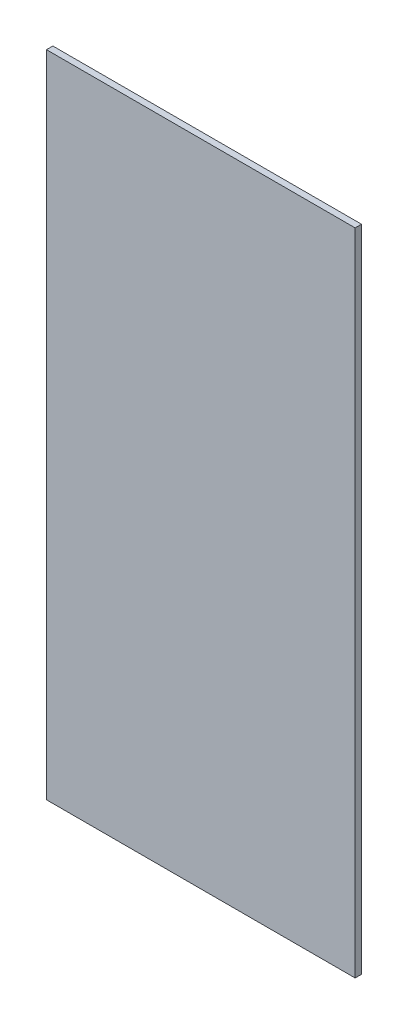
ISO-10303-21;
HEADER;
FILE_DESCRIPTION(('STEP AP214'),'2;1');
FILE_NAME('part.step','',(''),(''),'','','');
FILE_SCHEMA(('AUTOMOTIVE_DESIGN { 1 0 10303 214 1 1 1 1 }'));
ENDSEC;
DATA;
#1=APPLICATION_CONTEXT('core data for automotive mechanical design processes');
#2=APPLICATION_PROTOCOL_DEFINITION('international standard','automotive_design',2000,#1);
#3=PRODUCT_CONTEXT('',#1,'mechanical');
#4=PRODUCT('Part','Part','',(#3));
#5=PRODUCT_RELATED_PRODUCT_CATEGORY('part','',(#4));
#6=PRODUCT_DEFINITION_FORMATION('','',#4);
#7=PRODUCT_DEFINITION_CONTEXT('part definition',#1,'design');
#8=PRODUCT_DEFINITION('design','',#6,#7);
#9=PRODUCT_DEFINITION_SHAPE('','',#8);
#10=(LENGTH_UNIT() NAMED_UNIT(*) SI_UNIT(.MILLI.,.METRE.));
#11=(NAMED_UNIT(*) PLANE_ANGLE_UNIT() SI_UNIT($,.RADIAN.));
#12=(NAMED_UNIT(*) SI_UNIT($,.STERADIAN.) SOLID_ANGLE_UNIT());
#13=UNCERTAINTY_MEASURE_WITH_UNIT(LENGTH_MEASURE(1.E-05),#10,'distance_accuracy_value','');
#14=(GEOMETRIC_REPRESENTATION_CONTEXT(3) GLOBAL_UNCERTAINTY_ASSIGNED_CONTEXT((#13)) GLOBAL_UNIT_ASSIGNED_CONTEXT((#10,
#11,#12)) REPRESENTATION_CONTEXT('',''));
#15=CARTESIAN_POINT('',(0.,0.,0.));
#16=DIRECTION('',(0.,0.,1.));
#17=DIRECTION('',(1.,0.,0.));
#18=AXIS2_PLACEMENT_3D('',#15,#16,#17);
#19=CARTESIAN_POINT('',(-134.196553606128,367.959213729015,11.90625));
#20=DIRECTION('',(1.,0.,0.));
#21=DIRECTION('',(0.,1.,0.));
#22=AXIS2_PLACEMENT_3D('',#19,#20,#21);
#23=PLANE('',#22);
#24=DIRECTION('',(0.,-1.,0.));
#25=VECTOR('',#24,1.);
#26=CARTESIAN_POINT('',(-134.196553606128,367.959213729015,0.));
#27=LINE('',#26,#25);
#28=CARTESIAN_POINT('',(-134.196553606128,367.959213729015,0.));
#29=VERTEX_POINT('',#28);
#30=CARTESIAN_POINT('',(-134.196553606128,-844.890786270985,0.));
#31=VERTEX_POINT('',#30);
#32=EDGE_CURVE('E95',#29,#31,#27,.T.);
#33=ORIENTED_EDGE('',*,*,#32,.T.);
#34=DIRECTION('',(0.,0.,-1.));
#35=VECTOR('',#34,1.);
#36=CARTESIAN_POINT('',(-134.196553606128,-844.890786270985,11.90625));
#37=LINE('',#36,#35);
#38=CARTESIAN_POINT('',(-134.196553606128,-844.890786270985,11.90625));
#39=VERTEX_POINT('',#38);
#40=EDGE_CURVE('E11',#39,#31,#37,.T.);
#41=ORIENTED_EDGE('',*,*,#40,.F.);
#42=DIRECTION('',(0.,-1.,0.));
#43=VECTOR('',#42,1.);
#44=CARTESIAN_POINT('',(-134.196553606128,367.959213729015,11.90625));
#45=LINE('',#44,#43);
#46=CARTESIAN_POINT('',(-134.196553606128,367.959213729015,11.90625));
#47=VERTEX_POINT('',#46);
#48=EDGE_CURVE('E83',#47,#39,#45,.T.);
#49=ORIENTED_EDGE('',*,*,#48,.F.);
#50=DIRECTION('',(0.,0.,-1.));
#51=VECTOR('',#50,1.);
#52=CARTESIAN_POINT('',(-134.196553606128,367.959213729015,11.90625));
#53=LINE('',#52,#51);
#54=EDGE_CURVE('E91',#47,#29,#53,.T.);
#55=ORIENTED_EDGE('',*,*,#54,.T.);
#56=EDGE_LOOP('',(#33,#41,#49,#55));
#57=FACE_BOUND('',#56,.T.);
#58=ADVANCED_FACE('F32',(#57),#23,.F.);
#59=CARTESIAN_POINT('',(-134.196553606128,-844.890786270985,11.90625));
#60=DIRECTION('',(0.,1.,0.));
#61=DIRECTION('',(0.,0.,1.));
#62=AXIS2_PLACEMENT_3D('',#59,#60,#61);
#63=PLANE('',#62);
#64=DIRECTION('',(1.,0.,0.));
#65=VECTOR('',#64,1.);
#66=CARTESIAN_POINT('',(-134.196553606128,-844.890786270985,0.));
#67=LINE('',#66,#65);
#68=CARTESIAN_POINT('',(442.065946393872,-844.890786270985,0.));
#69=VERTEX_POINT('',#68);
#70=EDGE_CURVE('E87',#31,#69,#67,.T.);
#71=ORIENTED_EDGE('',*,*,#70,.T.);
#72=DIRECTION('',(0.,0.,-1.));
#73=VECTOR('',#72,1.);
#74=CARTESIAN_POINT('',(442.065946393872,-844.890786270985,11.90625));
#75=LINE('',#74,#73);
#76=CARTESIAN_POINT('',(442.065946393872,-844.890786270985,11.90625));
#77=VERTEX_POINT('',#76);
#78=EDGE_CURVE('E40',#77,#69,#75,.T.);
#79=ORIENTED_EDGE('',*,*,#78,.F.);
#80=DIRECTION('',(1.,0.,0.));
#81=VECTOR('',#80,1.);
#82=CARTESIAN_POINT('',(-134.196553606128,-844.890786270985,11.90625));
#83=LINE('',#82,#81);
#84=EDGE_CURVE('E78',#39,#77,#83,.T.);
#85=ORIENTED_EDGE('',*,*,#84,.F.);
#86=ORIENTED_EDGE('',*,*,#40,.T.);
#87=EDGE_LOOP('',(#71,#79,#85,#86));
#88=FACE_BOUND('',#87,.T.);
#89=ADVANCED_FACE('F86',(#88),#63,.F.);
#90=CARTESIAN_POINT('',(442.065946393872,367.959213729015,11.90625));
#91=DIRECTION('',(-1.,0.,0.));
#92=DIRECTION('',(0.,-1.,0.));
#93=AXIS2_PLACEMENT_3D('',#90,#91,#92);
#94=PLANE('',#93);
#95=DIRECTION('',(0.,1.,0.));
#96=VECTOR('',#95,1.);
#97=CARTESIAN_POINT('',(442.065946393872,367.959213729015,0.));
#98=LINE('',#97,#96);
#99=CARTESIAN_POINT('',(442.065946393872,367.959213729015,0.));
#100=VERTEX_POINT('',#99);
#101=EDGE_CURVE('E65',#69,#100,#98,.T.);
#102=ORIENTED_EDGE('',*,*,#101,.T.);
#103=DIRECTION('',(0.,0.,-1.));
#104=VECTOR('',#103,1.);
#105=CARTESIAN_POINT('',(442.065946393872,367.959213729015,11.90625));
#106=LINE('',#105,#104);
#107=CARTESIAN_POINT('',(442.065946393872,367.959213729015,11.90625));
#108=VERTEX_POINT('',#107);
#109=EDGE_CURVE('E88',#108,#100,#106,.T.);
#110=ORIENTED_EDGE('',*,*,#109,.F.);
#111=DIRECTION('',(0.,1.,0.));
#112=VECTOR('',#111,1.);
#113=CARTESIAN_POINT('',(442.065946393872,367.959213729015,11.90625));
#114=LINE('',#113,#112);
#115=EDGE_CURVE('E81',#77,#108,#114,.T.);
#116=ORIENTED_EDGE('',*,*,#115,.F.);
#117=ORIENTED_EDGE('',*,*,#78,.T.);
#118=EDGE_LOOP('',(#102,#110,#116,#117));
#119=FACE_BOUND('',#118,.T.);
#120=ADVANCED_FACE('F89',(#119),#94,.F.);
#121=CARTESIAN_POINT('',(-134.196553606128,367.959213729015,11.90625));
#122=DIRECTION('',(0.,-1.,0.));
#123=DIRECTION('',(0.,0.,-1.));
#124=AXIS2_PLACEMENT_3D('',#121,#122,#123);
#125=PLANE('',#124);
#126=DIRECTION('',(-1.,0.,0.));
#127=VECTOR('',#126,1.);
#128=CARTESIAN_POINT('',(-134.196553606128,367.959213729015,0.));
#129=LINE('',#128,#127);
#130=EDGE_CURVE('E71',#100,#29,#129,.T.);
#131=ORIENTED_EDGE('',*,*,#130,.T.);
#132=ORIENTED_EDGE('',*,*,#54,.F.);
#133=DIRECTION('',(-1.,0.,0.));
#134=VECTOR('',#133,1.);
#135=CARTESIAN_POINT('',(-134.196553606128,367.959213729015,11.90625));
#136=LINE('',#135,#134);
#137=EDGE_CURVE('E48',#108,#47,#136,.T.);
#138=ORIENTED_EDGE('',*,*,#137,.F.);
#139=ORIENTED_EDGE('',*,*,#109,.T.);
#140=EDGE_LOOP('',(#131,#132,#138,#139));
#141=FACE_BOUND('',#140,.T.);
#142=ADVANCED_FACE('F102',(#141),#125,.F.);
#143=CARTESIAN_POINT('',(0.,0.,11.90625));
#144=DIRECTION('',(0.,0.,1.));
#145=DIRECTION('',(1.,0.,0.));
#146=AXIS2_PLACEMENT_3D('',#143,#144,#145);
#147=PLANE('',#146);
#148=ORIENTED_EDGE('',*,*,#48,.T.);
#149=ORIENTED_EDGE('',*,*,#84,.T.);
#150=ORIENTED_EDGE('',*,*,#115,.T.);
#151=ORIENTED_EDGE('',*,*,#137,.T.);
#152=EDGE_LOOP('',(#148,#149,#150,#151));
#153=FACE_BOUND('',#152,.T.);
#154=ADVANCED_FACE('F79',(#153),#147,.T.);
#155=CARTESIAN_POINT('',(0.,0.,0.));
#156=DIRECTION('',(0.,0.,1.));
#157=DIRECTION('',(1.,0.,0.));
#158=AXIS2_PLACEMENT_3D('',#155,#156,#157);
#159=PLANE('',#158);
#160=ORIENTED_EDGE('',*,*,#32,.F.);
#161=ORIENTED_EDGE('',*,*,#130,.F.);
#162=ORIENTED_EDGE('',*,*,#101,.F.);
#163=ORIENTED_EDGE('',*,*,#70,.F.);
#164=EDGE_LOOP('',(#160,#161,#162,#163));
#165=FACE_BOUND('',#164,.T.);
#166=ADVANCED_FACE('F105',(#165),#159,.F.);
#167=CLOSED_SHELL('',(#58,#89,#120,#142,#154,#166));
#168=MANIFOLD_SOLID_BREP('B2',#167);
#169=ADVANCED_BREP_SHAPE_REPRESENTATION('',(#18,#168),#14);
#170=SHAPE_DEFINITION_REPRESENTATION(#9,#169);
ENDSEC;
END-ISO-10303-21;
